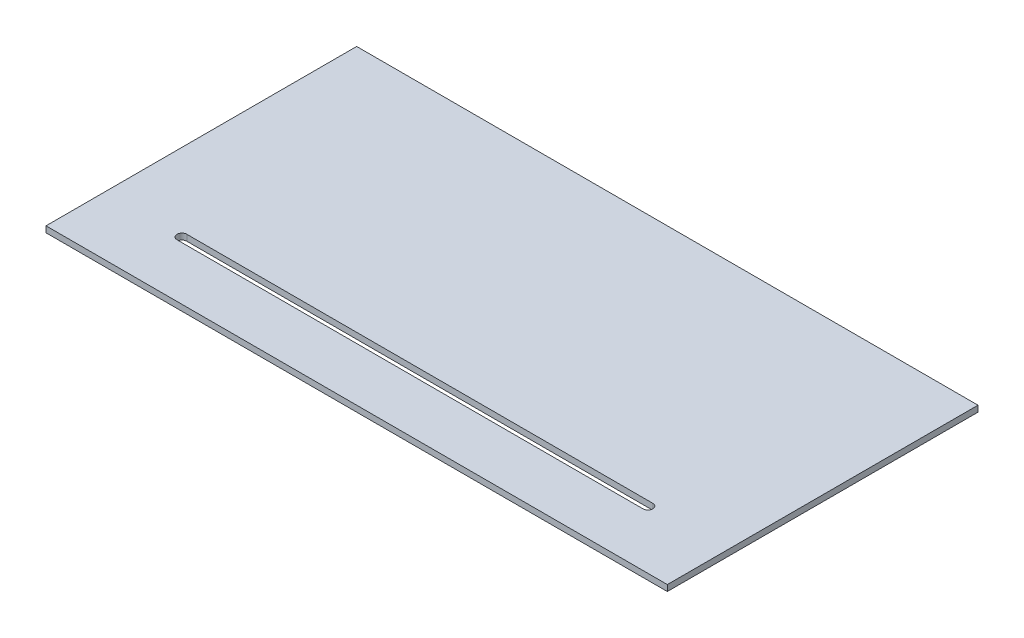
ISO-10303-21;
HEADER;
FILE_DESCRIPTION(('STEP AP214'),'2;1');
FILE_NAME('part.step','',(''),(''),'','','');
FILE_SCHEMA(('AUTOMOTIVE_DESIGN { 1 0 10303 214 1 1 1 1 }'));
ENDSEC;
DATA;
#1=APPLICATION_CONTEXT('core data for automotive mechanical design processes');
#2=APPLICATION_PROTOCOL_DEFINITION('international standard','automotive_design',2000,#1);
#3=PRODUCT_CONTEXT('',#1,'mechanical');
#4=PRODUCT('Part','Part','',(#3));
#5=PRODUCT_RELATED_PRODUCT_CATEGORY('part','',(#4));
#6=PRODUCT_DEFINITION_FORMATION('','',#4);
#7=PRODUCT_DEFINITION_CONTEXT('part definition',#1,'design');
#8=PRODUCT_DEFINITION('design','',#6,#7);
#9=PRODUCT_DEFINITION_SHAPE('','',#8);
#10=(LENGTH_UNIT() NAMED_UNIT(*) SI_UNIT(.MILLI.,.METRE.));
#11=(NAMED_UNIT(*) PLANE_ANGLE_UNIT() SI_UNIT($,.RADIAN.));
#12=(NAMED_UNIT(*) SI_UNIT($,.STERADIAN.) SOLID_ANGLE_UNIT());
#13=UNCERTAINTY_MEASURE_WITH_UNIT(LENGTH_MEASURE(1.E-05),#10,'distance_accuracy_value','');
#14=(GEOMETRIC_REPRESENTATION_CONTEXT(3) GLOBAL_UNCERTAINTY_ASSIGNED_CONTEXT((#13)) GLOBAL_UNIT_ASSIGNED_CONTEXT((#10,
#11,#12)) REPRESENTATION_CONTEXT('',''));
#15=CARTESIAN_POINT('',(0.,0.,0.));
#16=DIRECTION('',(0.,0.,1.));
#17=DIRECTION('',(1.,0.,0.));
#18=AXIS2_PLACEMENT_3D('',#15,#16,#17);
#19=CARTESIAN_POINT('',(609.6,11.90625,304.8));
#20=DIRECTION('',(-1.,0.,0.));
#21=DIRECTION('',(0.,0.,1.));
#22=AXIS2_PLACEMENT_3D('',#19,#20,#21);
#23=PLANE('',#22);
#24=DIRECTION('',(0.,0.,-1.));
#25=VECTOR('',#24,1.);
#26=CARTESIAN_POINT('',(609.6,0.,304.8));
#27=LINE('',#26,#25);
#28=CARTESIAN_POINT('',(609.6,0.,304.8));
#29=VERTEX_POINT('',#28);
#30=CARTESIAN_POINT('',(609.6,0.,-304.8));
#31=VERTEX_POINT('',#30);
#32=EDGE_CURVE('E147',#29,#31,#27,.T.);
#33=ORIENTED_EDGE('',*,*,#32,.T.);
#34=DIRECTION('',(0.,-1.,0.));
#35=VECTOR('',#34,1.);
#36=CARTESIAN_POINT('',(609.6,11.90625,-304.8));
#37=LINE('',#36,#35);
#38=CARTESIAN_POINT('',(609.6,11.90625,-304.8));
#39=VERTEX_POINT('',#38);
#40=EDGE_CURVE('E11',#39,#31,#37,.T.);
#41=ORIENTED_EDGE('',*,*,#40,.F.);
#42=DIRECTION('',(0.,0.,-1.));
#43=VECTOR('',#42,1.);
#44=CARTESIAN_POINT('',(609.6,11.90625,304.8));
#45=LINE('',#44,#43);
#46=CARTESIAN_POINT('',(609.6,11.90625,304.8));
#47=VERTEX_POINT('',#46);
#48=EDGE_CURVE('E153',#47,#39,#45,.T.);
#49=ORIENTED_EDGE('',*,*,#48,.F.);
#50=DIRECTION('',(0.,-1.,0.));
#51=VECTOR('',#50,1.);
#52=CARTESIAN_POINT('',(609.6,11.90625,304.8));
#53=LINE('',#52,#51);
#54=EDGE_CURVE('E167',#47,#29,#53,.T.);
#55=ORIENTED_EDGE('',*,*,#54,.T.);
#56=EDGE_LOOP('',(#33,#41,#49,#55));
#57=FACE_BOUND('',#56,.T.);
#58=ADVANCED_FACE('F39',(#57),#23,.F.);
#59=CARTESIAN_POINT('',(-609.6,11.90625,-304.8));
#60=DIRECTION('',(0.,0.,1.));
#61=DIRECTION('',(1.,0.,0.));
#62=AXIS2_PLACEMENT_3D('',#59,#60,#61);
#63=PLANE('',#62);
#64=DIRECTION('',(-1.,0.,0.));
#65=VECTOR('',#64,1.);
#66=CARTESIAN_POINT('',(-609.6,0.,-304.8));
#67=LINE('',#66,#65);
#68=CARTESIAN_POINT('',(-609.6,0.,-304.8));
#69=VERTEX_POINT('',#68);
#70=EDGE_CURVE('E171',#31,#69,#67,.T.);
#71=ORIENTED_EDGE('',*,*,#70,.T.);
#72=DIRECTION('',(0.,-1.,0.));
#73=VECTOR('',#72,1.);
#74=CARTESIAN_POINT('',(-609.6,11.90625,-304.8));
#75=LINE('',#74,#73);
#76=CARTESIAN_POINT('',(-609.6,11.90625,-304.8));
#77=VERTEX_POINT('',#76);
#78=EDGE_CURVE('E47',#77,#69,#75,.T.);
#79=ORIENTED_EDGE('',*,*,#78,.F.);
#80=DIRECTION('',(-1.,0.,0.));
#81=VECTOR('',#80,1.);
#82=CARTESIAN_POINT('',(-609.6,11.90625,-304.8));
#83=LINE('',#82,#81);
#84=EDGE_CURVE('E157',#39,#77,#83,.T.);
#85=ORIENTED_EDGE('',*,*,#84,.F.);
#86=ORIENTED_EDGE('',*,*,#40,.T.);
#87=EDGE_LOOP('',(#71,#79,#85,#86));
#88=FACE_BOUND('',#87,.T.);
#89=ADVANCED_FACE('F205',(#88),#63,.F.);
#90=CARTESIAN_POINT('',(-609.6,11.90625,304.8));
#91=DIRECTION('',(1.,0.,0.));
#92=DIRECTION('',(0.,0.,-1.));
#93=AXIS2_PLACEMENT_3D('',#90,#91,#92);
#94=PLANE('',#93);
#95=DIRECTION('',(0.,0.,1.));
#96=VECTOR('',#95,1.);
#97=CARTESIAN_POINT('',(-609.6,0.,304.8));
#98=LINE('',#97,#96);
#99=CARTESIAN_POINT('',(-609.6,0.,304.8));
#100=VERTEX_POINT('',#99);
#101=EDGE_CURVE('E174',#69,#100,#98,.T.);
#102=ORIENTED_EDGE('',*,*,#101,.T.);
#103=DIRECTION('',(0.,-1.,0.));
#104=VECTOR('',#103,1.);
#105=CARTESIAN_POINT('',(-609.6,11.90625,304.8));
#106=LINE('',#105,#104);
#107=CARTESIAN_POINT('',(-609.6,11.90625,304.8));
#108=VERTEX_POINT('',#107);
#109=EDGE_CURVE('E182',#108,#100,#106,.T.);
#110=ORIENTED_EDGE('',*,*,#109,.F.);
#111=DIRECTION('',(0.,0.,1.));
#112=VECTOR('',#111,1.);
#113=CARTESIAN_POINT('',(-609.6,11.90625,304.8));
#114=LINE('',#113,#112);
#115=EDGE_CURVE('E161',#77,#108,#114,.T.);
#116=ORIENTED_EDGE('',*,*,#115,.F.);
#117=ORIENTED_EDGE('',*,*,#78,.T.);
#118=EDGE_LOOP('',(#102,#110,#116,#117));
#119=FACE_BOUND('',#118,.T.);
#120=ADVANCED_FACE('F191',(#119),#94,.F.);
#121=CARTESIAN_POINT('',(-609.6,11.90625,304.8));
#122=DIRECTION('',(0.,0.,-1.));
#123=DIRECTION('',(-1.,0.,0.));
#124=AXIS2_PLACEMENT_3D('',#121,#122,#123);
#125=PLANE('',#124);
#126=DIRECTION('',(1.,0.,0.));
#127=VECTOR('',#126,1.);
#128=CARTESIAN_POINT('',(-609.6,0.,304.8));
#129=LINE('',#128,#127);
#130=EDGE_CURVE('E158',#100,#29,#129,.T.);
#131=ORIENTED_EDGE('',*,*,#130,.T.);
#132=ORIENTED_EDGE('',*,*,#54,.F.);
#133=DIRECTION('',(1.,0.,0.));
#134=VECTOR('',#133,1.);
#135=CARTESIAN_POINT('',(-609.6,11.90625,304.8));
#136=LINE('',#135,#134);
#137=EDGE_CURVE('E164',#108,#47,#136,.T.);
#138=ORIENTED_EDGE('',*,*,#137,.F.);
#139=ORIENTED_EDGE('',*,*,#109,.T.);
#140=EDGE_LOOP('',(#131,#132,#138,#139));
#141=FACE_BOUND('',#140,.T.);
#142=ADVANCED_FACE('F198',(#141),#125,.F.);
#143=CARTESIAN_POINT('',(0.,11.90625,0.));
#144=DIRECTION('',(0.,-1.,0.));
#145=DIRECTION('',(0.,0.,-1.));
#146=AXIS2_PLACEMENT_3D('',#143,#144,#145);
#147=PLANE('',#146);
#148=DIRECTION('',(1.,0.,0.));
#149=VECTOR('',#148,1.);
#150=CARTESIAN_POINT('',(-457.2,11.90625,200.025));
#151=LINE('',#150,#149);
#152=CARTESIAN_POINT('',(-457.2,11.90625,200.025));
#153=VERTEX_POINT('',#152);
#154=CARTESIAN_POINT('',(457.2,11.90625,200.025));
#155=VERTEX_POINT('',#154);
#156=EDGE_CURVE('E138',#153,#155,#151,.T.);
#157=ORIENTED_EDGE('',*,*,#156,.F.);
#158=CARTESIAN_POINT('',(-457.2,11.90625,190.5));
#159=DIRECTION('',(0.,1.,0.));
#160=DIRECTION('',(0.,0.,1.));
#161=AXIS2_PLACEMENT_3D('',#158,#159,#160);
#162=CIRCLE('',#161,9.52500000000001);
#163=CARTESIAN_POINT('',(-457.2,11.90625,180.975));
#164=VERTEX_POINT('',#163);
#165=EDGE_CURVE('E54',#164,#153,#162,.T.);
#166=ORIENTED_EDGE('',*,*,#165,.F.);
#167=DIRECTION('',(-1.,0.,0.));
#168=VECTOR('',#167,1.);
#169=CARTESIAN_POINT('',(-457.2,11.90625,180.975));
#170=LINE('',#169,#168);
#171=CARTESIAN_POINT('',(457.2,11.90625,180.975));
#172=VERTEX_POINT('',#171);
#173=EDGE_CURVE('E125',#172,#164,#170,.T.);
#174=ORIENTED_EDGE('',*,*,#173,.F.);
#175=CARTESIAN_POINT('',(457.2,11.90625,190.5));
#176=DIRECTION('',(0.,1.,0.));
#177=DIRECTION('',(0.,0.,1.));
#178=AXIS2_PLACEMENT_3D('',#175,#176,#177);
#179=CIRCLE('',#178,9.52500000000001);
#180=EDGE_CURVE('E129',#155,#172,#179,.T.);
#181=ORIENTED_EDGE('',*,*,#180,.F.);
#182=EDGE_LOOP('',(#157,#166,#174,#181));
#183=FACE_BOUND('',#182,.T.);
#184=ORIENTED_EDGE('',*,*,#48,.T.);
#185=ORIENTED_EDGE('',*,*,#84,.T.);
#186=ORIENTED_EDGE('',*,*,#115,.T.);
#187=ORIENTED_EDGE('',*,*,#137,.T.);
#188=EDGE_LOOP('',(#184,#185,#186,#187));
#189=FACE_BOUND('',#188,.T.);
#190=ADVANCED_FACE('F204',(#183,#189),#147,.F.);
#191=CARTESIAN_POINT('',(0.,0.,0.));
#192=DIRECTION('',(0.,-1.,0.));
#193=DIRECTION('',(0.,0.,-1.));
#194=AXIS2_PLACEMENT_3D('',#191,#192,#193);
#195=PLANE('',#194);
#196=CARTESIAN_POINT('',(-457.2,0.,190.5));
#197=DIRECTION('',(0.,1.,0.));
#198=DIRECTION('',(0.,0.,1.));
#199=AXIS2_PLACEMENT_3D('',#196,#197,#198);
#200=CIRCLE('',#199,9.52500000000001);
#201=CARTESIAN_POINT('',(-457.2,0.,180.975));
#202=VERTEX_POINT('',#201);
#203=CARTESIAN_POINT('',(-457.2,0.,200.025));
#204=VERTEX_POINT('',#203);
#205=EDGE_CURVE('E106',#202,#204,#200,.T.);
#206=ORIENTED_EDGE('',*,*,#205,.T.);
#207=DIRECTION('',(1.,0.,0.));
#208=VECTOR('',#207,1.);
#209=CARTESIAN_POINT('',(-457.2,0.,200.025));
#210=LINE('',#209,#208);
#211=CARTESIAN_POINT('',(457.2,0.,200.025));
#212=VERTEX_POINT('',#211);
#213=EDGE_CURVE('E116',#204,#212,#210,.T.);
#214=ORIENTED_EDGE('',*,*,#213,.T.);
#215=CARTESIAN_POINT('',(457.2,0.,190.5));
#216=DIRECTION('',(0.,1.,0.));
#217=DIRECTION('',(0.,0.,1.));
#218=AXIS2_PLACEMENT_3D('',#215,#216,#217);
#219=CIRCLE('',#218,9.52500000000001);
#220=CARTESIAN_POINT('',(457.2,0.,180.975));
#221=VERTEX_POINT('',#220);
#222=EDGE_CURVE('E62',#212,#221,#219,.T.);
#223=ORIENTED_EDGE('',*,*,#222,.T.);
#224=DIRECTION('',(-1.,0.,0.));
#225=VECTOR('',#224,1.);
#226=CARTESIAN_POINT('',(-457.2,0.,180.975));
#227=LINE('',#226,#225);
#228=EDGE_CURVE('E113',#221,#202,#227,.T.);
#229=ORIENTED_EDGE('',*,*,#228,.T.);
#230=EDGE_LOOP('',(#206,#214,#223,#229));
#231=FACE_BOUND('',#230,.T.);
#232=ORIENTED_EDGE('',*,*,#32,.F.);
#233=ORIENTED_EDGE('',*,*,#130,.F.);
#234=ORIENTED_EDGE('',*,*,#101,.F.);
#235=ORIENTED_EDGE('',*,*,#70,.F.);
#236=EDGE_LOOP('',(#232,#233,#234,#235));
#237=FACE_BOUND('',#236,.T.);
#238=ADVANCED_FACE('F121',(#231,#237),#195,.T.);
#239=CARTESIAN_POINT('',(-457.2,0.,190.5));
#240=DIRECTION('',(0.,1.,0.));
#241=DIRECTION('',(0.,0.,1.));
#242=AXIS2_PLACEMENT_3D('',#239,#240,#241);
#243=CYLINDRICAL_SURFACE('',#242,9.52500000000001);
#244=ORIENTED_EDGE('',*,*,#165,.T.);
#245=DIRECTION('',(0.,1.,0.));
#246=VECTOR('',#245,1.);
#247=CARTESIAN_POINT('',(-457.2,0.,200.025));
#248=LINE('',#247,#246);
#249=EDGE_CURVE('E102',#204,#153,#248,.T.);
#250=ORIENTED_EDGE('',*,*,#249,.F.);
#251=ORIENTED_EDGE('',*,*,#205,.F.);
#252=DIRECTION('',(0.,1.,0.));
#253=VECTOR('',#252,1.);
#254=CARTESIAN_POINT('',(-457.2,0.,180.975));
#255=LINE('',#254,#253);
#256=EDGE_CURVE('E144',#202,#164,#255,.T.);
#257=ORIENTED_EDGE('',*,*,#256,.T.);
#258=EDGE_LOOP('',(#244,#250,#251,#257));
#259=FACE_BOUND('',#258,.T.);
#260=ADVANCED_FACE('F104',(#259),#243,.F.);
#261=CARTESIAN_POINT('',(-457.2,0.,180.975));
#262=DIRECTION('',(0.,0.,-1.));
#263=DIRECTION('',(-1.,0.,0.));
#264=AXIS2_PLACEMENT_3D('',#261,#262,#263);
#265=PLANE('',#264);
#266=ORIENTED_EDGE('',*,*,#173,.T.);
#267=ORIENTED_EDGE('',*,*,#256,.F.);
#268=ORIENTED_EDGE('',*,*,#228,.F.);
#269=DIRECTION('',(0.,1.,0.));
#270=VECTOR('',#269,1.);
#271=CARTESIAN_POINT('',(457.2,0.,180.975));
#272=LINE('',#271,#270);
#273=EDGE_CURVE('E148',#221,#172,#272,.T.);
#274=ORIENTED_EDGE('',*,*,#273,.T.);
#275=EDGE_LOOP('',(#266,#267,#268,#274));
#276=FACE_BOUND('',#275,.T.);
#277=ADVANCED_FACE('F222',(#276),#265,.F.);
#278=CARTESIAN_POINT('',(457.2,0.,190.5));
#279=DIRECTION('',(0.,1.,0.));
#280=DIRECTION('',(0.,0.,1.));
#281=AXIS2_PLACEMENT_3D('',#278,#279,#280);
#282=CYLINDRICAL_SURFACE('',#281,9.52500000000001);
#283=ORIENTED_EDGE('',*,*,#180,.T.);
#284=ORIENTED_EDGE('',*,*,#273,.F.);
#285=ORIENTED_EDGE('',*,*,#222,.F.);
#286=DIRECTION('',(0.,1.,0.));
#287=VECTOR('',#286,1.);
#288=CARTESIAN_POINT('',(457.2,0.,200.025));
#289=LINE('',#288,#287);
#290=EDGE_CURVE('E112',#212,#155,#289,.T.);
#291=ORIENTED_EDGE('',*,*,#290,.T.);
#292=EDGE_LOOP('',(#283,#284,#285,#291));
#293=FACE_BOUND('',#292,.T.);
#294=ADVANCED_FACE('F225',(#293),#282,.F.);
#295=CARTESIAN_POINT('',(-457.2,0.,200.025));
#296=DIRECTION('',(0.,0.,1.));
#297=DIRECTION('',(1.,0.,0.));
#298=AXIS2_PLACEMENT_3D('',#295,#296,#297);
#299=PLANE('',#298);
#300=ORIENTED_EDGE('',*,*,#156,.T.);
#301=ORIENTED_EDGE('',*,*,#290,.F.);
#302=ORIENTED_EDGE('',*,*,#213,.F.);
#303=ORIENTED_EDGE('',*,*,#249,.T.);
#304=EDGE_LOOP('',(#300,#301,#302,#303));
#305=FACE_BOUND('',#304,.T.);
#306=ADVANCED_FACE('F117',(#305),#299,.F.);
#307=CLOSED_SHELL('',(#58,#89,#120,#142,#190,#238,#260,#277,#294,#306));
#308=MANIFOLD_SOLID_BREP('B2',#307);
#309=ADVANCED_BREP_SHAPE_REPRESENTATION('',(#18,#308),#14);
#310=SHAPE_DEFINITION_REPRESENTATION(#9,#309);
ENDSEC;
END-ISO-10303-21;
